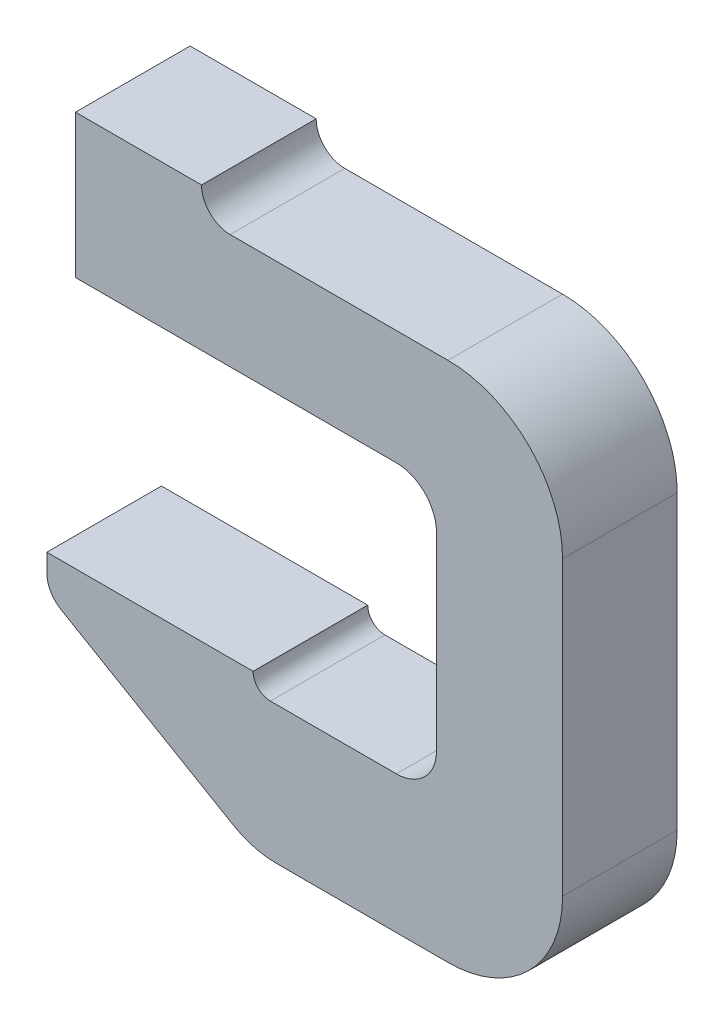
ISO-10303-21;
HEADER;
FILE_DESCRIPTION(('STEP AP214'),'2;1');
FILE_NAME('part.step','',(''),(''),'','','');
FILE_SCHEMA(('AUTOMOTIVE_DESIGN { 1 0 10303 214 1 1 1 1 }'));
ENDSEC;
DATA;
#1=APPLICATION_CONTEXT('core data for automotive mechanical design processes');
#2=APPLICATION_PROTOCOL_DEFINITION('international standard','automotive_design',2000,#1);
#3=PRODUCT_CONTEXT('',#1,'mechanical');
#4=PRODUCT('Part','Part','',(#3));
#5=PRODUCT_RELATED_PRODUCT_CATEGORY('part','',(#4));
#6=PRODUCT_DEFINITION_FORMATION('','',#4);
#7=PRODUCT_DEFINITION_CONTEXT('part definition',#1,'design');
#8=PRODUCT_DEFINITION('design','',#6,#7);
#9=PRODUCT_DEFINITION_SHAPE('','',#8);
#10=(LENGTH_UNIT() NAMED_UNIT(*) SI_UNIT(.MILLI.,.METRE.));
#11=(NAMED_UNIT(*) PLANE_ANGLE_UNIT() SI_UNIT($,.RADIAN.));
#12=(NAMED_UNIT(*) SI_UNIT($,.STERADIAN.) SOLID_ANGLE_UNIT());
#13=UNCERTAINTY_MEASURE_WITH_UNIT(LENGTH_MEASURE(1.E-05),#10,'distance_accuracy_value','');
#14=(GEOMETRIC_REPRESENTATION_CONTEXT(3) GLOBAL_UNCERTAINTY_ASSIGNED_CONTEXT((#13)) GLOBAL_UNIT_ASSIGNED_CONTEXT((#10,
#11,#12)) REPRESENTATION_CONTEXT('',''));
#15=CARTESIAN_POINT('',(0.,0.,0.));
#16=DIRECTION('',(0.,0.,1.));
#17=DIRECTION('',(1.,0.,0.));
#18=AXIS2_PLACEMENT_3D('',#15,#16,#17);
#19=CARTESIAN_POINT('',(-540.,0.,200.));
#20=DIRECTION('',(0.,1.,0.));
#21=DIRECTION('',(0.,0.,1.));
#22=AXIS2_PLACEMENT_3D('',#19,#20,#21);
#23=PLANE('',#22);
#24=DIRECTION('',(1.,0.,0.));
#25=VECTOR('',#24,1.);
#26=CARTESIAN_POINT('',(-540.,0.,200.));
#27=LINE('',#26,#25);
#28=CARTESIAN_POINT('',(-499.447628797504,0.,200.));
#29=VERTEX_POINT('',#28);
#30=CARTESIAN_POINT('',(-200.,0.,200.));
#31=VERTEX_POINT('',#30);
#32=EDGE_CURVE('E257',#29,#31,#27,.T.);
#33=ORIENTED_EDGE('',*,*,#32,.F.);
#34=DIRECTION('',(0.,0.,-1.));
#35=VECTOR('',#34,1.);
#36=CARTESIAN_POINT('',(-499.447628797504,0.,200.));
#37=LINE('',#36,#35);
#38=CARTESIAN_POINT('',(-499.447628797504,0.,0.));
#39=VERTEX_POINT('',#38);
#40=EDGE_CURVE('E250',#29,#39,#37,.T.);
#41=ORIENTED_EDGE('',*,*,#40,.T.);
#42=DIRECTION('',(1.,0.,0.));
#43=VECTOR('',#42,1.);
#44=CARTESIAN_POINT('',(-540.,0.,0.));
#45=LINE('',#44,#43);
#46=CARTESIAN_POINT('',(-200.,0.,0.));
#47=VERTEX_POINT('',#46);
#48=EDGE_CURVE('E256',#39,#47,#45,.T.);
#49=ORIENTED_EDGE('',*,*,#48,.T.);
#50=DIRECTION('',(0.,0.,-1.));
#51=VECTOR('',#50,1.);
#52=CARTESIAN_POINT('',(-200.,0.,200.));
#53=LINE('',#52,#51);
#54=EDGE_CURVE('E210',#47,#31,#53,.F.);
#55=ORIENTED_EDGE('',*,*,#54,.T.);
#56=EDGE_LOOP('',(#33,#41,#49,#55));
#57=FACE_BOUND('',#56,.T.);
#58=ADVANCED_FACE('F33',(#57),#23,.F.);
#59=CARTESIAN_POINT('',(0.,0.,200.));
#60=DIRECTION('',(-1.,0.,0.));
#61=DIRECTION('',(0.,0.,1.));
#62=AXIS2_PLACEMENT_3D('',#59,#60,#61);
#63=PLANE('',#62);
#64=DIRECTION('',(0.,1.,0.));
#65=VECTOR('',#64,1.);
#66=CARTESIAN_POINT('',(0.,0.,200.));
#67=LINE('',#66,#65);
#68=CARTESIAN_POINT('',(0.,200.,200.));
#69=VERTEX_POINT('',#68);
#70=CARTESIAN_POINT('',(0.,710.,200.));
#71=VERTEX_POINT('',#70);
#72=EDGE_CURVE('E521',#69,#71,#67,.T.);
#73=ORIENTED_EDGE('',*,*,#72,.F.);
#74=DIRECTION('',(0.,0.,-1.));
#75=VECTOR('',#74,1.);
#76=CARTESIAN_POINT('',(0.,200.,200.));
#77=LINE('',#76,#75);
#78=CARTESIAN_POINT('',(0.,200.,0.));
#79=VERTEX_POINT('',#78);
#80=EDGE_CURVE('E204',#69,#79,#77,.T.);
#81=ORIENTED_EDGE('',*,*,#80,.T.);
#82=DIRECTION('',(0.,1.,0.));
#83=VECTOR('',#82,1.);
#84=CARTESIAN_POINT('',(0.,0.,0.));
#85=LINE('',#84,#83);
#86=CARTESIAN_POINT('',(0.,710.,0.));
#87=VERTEX_POINT('',#86);
#88=EDGE_CURVE('E263',#79,#87,#85,.T.);
#89=ORIENTED_EDGE('',*,*,#88,.T.);
#90=DIRECTION('',(0.,0.,-1.));
#91=VECTOR('',#90,1.);
#92=CARTESIAN_POINT('',(0.,710.,200.));
#93=LINE('',#92,#91);
#94=EDGE_CURVE('E199',#87,#71,#93,.F.);
#95=ORIENTED_EDGE('',*,*,#94,.T.);
#96=EDGE_LOOP('',(#73,#81,#89,#95));
#97=FACE_BOUND('',#96,.T.);
#98=ADVANCED_FACE('F341',(#97),#63,.F.);
#99=CARTESIAN_POINT('',(0.,910.,200.));
#100=DIRECTION('',(0.,-1.,0.));
#101=DIRECTION('',(1.,0.,0.));
#102=AXIS2_PLACEMENT_3D('',#99,#100,#101);
#103=PLANE('',#102);
#104=DIRECTION('',(-1.,0.,0.));
#105=VECTOR('',#104,1.);
#106=CARTESIAN_POINT('',(0.,910.,0.));
#107=LINE('',#106,#105);
#108=CARTESIAN_POINT('',(-200.,910.,0.));
#109=VERTEX_POINT('',#108);
#110=CARTESIAN_POINT('',(-580.,910.,0.));
#111=VERTEX_POINT('',#110);
#112=EDGE_CURVE('E265',#109,#111,#107,.T.);
#113=ORIENTED_EDGE('',*,*,#112,.T.);
#114=DIRECTION('',(0.,0.,-1.));
#115=VECTOR('',#114,1.);
#116=CARTESIAN_POINT('',(-580.,910.,200.));
#117=LINE('',#116,#115);
#118=CARTESIAN_POINT('',(-580.,910.,200.));
#119=VERTEX_POINT('',#118);
#120=EDGE_CURVE('E239',#111,#119,#117,.F.);
#121=ORIENTED_EDGE('',*,*,#120,.T.);
#122=DIRECTION('',(-1.,0.,0.));
#123=VECTOR('',#122,1.);
#124=CARTESIAN_POINT('',(0.,910.,200.));
#125=LINE('',#124,#123);
#126=CARTESIAN_POINT('',(-200.,910.,200.));
#127=VERTEX_POINT('',#126);
#128=EDGE_CURVE('E170',#127,#119,#125,.T.);
#129=ORIENTED_EDGE('',*,*,#128,.F.);
#130=DIRECTION('',(0.,0.,-1.));
#131=VECTOR('',#130,1.);
#132=CARTESIAN_POINT('',(-200.,910.,200.));
#133=LINE('',#132,#131);
#134=EDGE_CURVE('E188',#127,#109,#133,.T.);
#135=ORIENTED_EDGE('',*,*,#134,.T.);
#136=EDGE_LOOP('',(#113,#121,#129,#135));
#137=FACE_BOUND('',#136,.T.);
#138=ADVANCED_FACE('F346',(#137),#103,.F.);
#139=CARTESIAN_POINT('',(-630.,960.,200.));
#140=DIRECTION('',(0.,-1.,0.));
#141=DIRECTION('',(0.,0.,-1.));
#142=AXIS2_PLACEMENT_3D('',#139,#140,#141);
#143=PLANE('',#142);
#144=DIRECTION('',(-1.,0.,0.));
#145=VECTOR('',#144,1.);
#146=CARTESIAN_POINT('',(-630.,960.,0.));
#147=LINE('',#146,#145);
#148=CARTESIAN_POINT('',(-630.,960.,0.));
#149=VERTEX_POINT('',#148);
#150=CARTESIAN_POINT('',(-850.,960.,0.));
#151=VERTEX_POINT('',#150);
#152=EDGE_CURVE('E273',#149,#151,#147,.T.);
#153=ORIENTED_EDGE('',*,*,#152,.T.);
#154=DIRECTION('',(0.,0.,-1.));
#155=VECTOR('',#154,1.);
#156=CARTESIAN_POINT('',(-850.,960.,200.));
#157=LINE('',#156,#155);
#158=CARTESIAN_POINT('',(-850.,960.,200.));
#159=VERTEX_POINT('',#158);
#160=EDGE_CURVE('E183',#159,#151,#157,.T.);
#161=ORIENTED_EDGE('',*,*,#160,.F.);
#162=DIRECTION('',(-1.,0.,0.));
#163=VECTOR('',#162,1.);
#164=CARTESIAN_POINT('',(-630.,960.,200.));
#165=LINE('',#164,#163);
#166=CARTESIAN_POINT('',(-630.,960.,200.));
#167=VERTEX_POINT('',#166);
#168=EDGE_CURVE('E167',#167,#159,#165,.T.);
#169=ORIENTED_EDGE('',*,*,#168,.F.);
#170=DIRECTION('',(0.,0.,-1.));
#171=VECTOR('',#170,1.);
#172=CARTESIAN_POINT('',(-630.,960.,200.));
#173=LINE('',#172,#171);
#174=EDGE_CURVE('E180',#167,#149,#173,.T.);
#175=ORIENTED_EDGE('',*,*,#174,.T.);
#176=EDGE_LOOP('',(#153,#161,#169,#175));
#177=FACE_BOUND('',#176,.T.);
#178=ADVANCED_FACE('F179',(#177),#143,.F.);
#179=CARTESIAN_POINT('',(-850.,960.,200.));
#180=DIRECTION('',(1.,0.,0.));
#181=DIRECTION('',(0.,0.,-1.));
#182=AXIS2_PLACEMENT_3D('',#179,#180,#181);
#183=PLANE('',#182);
#184=DIRECTION('',(0.,-1.,0.));
#185=VECTOR('',#184,1.);
#186=CARTESIAN_POINT('',(-850.,960.,0.));
#187=LINE('',#186,#185);
#188=CARTESIAN_POINT('',(-850.,710.,0.));
#189=VERTEX_POINT('',#188);
#190=EDGE_CURVE('E275',#151,#189,#187,.T.);
#191=ORIENTED_EDGE('',*,*,#190,.T.);
#192=DIRECTION('',(0.,0.,-1.));
#193=VECTOR('',#192,1.);
#194=CARTESIAN_POINT('',(-850.,710.,200.));
#195=LINE('',#194,#193);
#196=CARTESIAN_POINT('',(-850.,710.,200.));
#197=VERTEX_POINT('',#196);
#198=EDGE_CURVE('E193',#197,#189,#195,.T.);
#199=ORIENTED_EDGE('',*,*,#198,.F.);
#200=DIRECTION('',(0.,-1.,0.));
#201=VECTOR('',#200,1.);
#202=CARTESIAN_POINT('',(-850.,960.,200.));
#203=LINE('',#202,#201);
#204=EDGE_CURVE('E185',#159,#197,#203,.T.);
#205=ORIENTED_EDGE('',*,*,#204,.F.);
#206=ORIENTED_EDGE('',*,*,#160,.T.);
#207=EDGE_LOOP('',(#191,#199,#205,#206));
#208=FACE_BOUND('',#207,.T.);
#209=ADVANCED_FACE('F482',(#208),#183,.F.);
#210=CARTESIAN_POINT('',(-850.,710.,200.));
#211=DIRECTION('',(0.,1.,0.));
#212=DIRECTION('',(0.,0.,1.));
#213=AXIS2_PLACEMENT_3D('',#210,#211,#212);
#214=PLANE('',#213);
#215=DIRECTION('',(1.,0.,0.));
#216=VECTOR('',#215,1.);
#217=CARTESIAN_POINT('',(-850.,710.,0.));
#218=LINE('',#217,#216);
#219=CARTESIAN_POINT('',(-290.,710.,0.));
#220=VERTEX_POINT('',#219);
#221=EDGE_CURVE('E277',#189,#220,#218,.T.);
#222=ORIENTED_EDGE('',*,*,#221,.T.);
#223=DIRECTION('',(0.,0.,-1.));
#224=VECTOR('',#223,1.);
#225=CARTESIAN_POINT('',(-290.,710.,200.));
#226=LINE('',#225,#224);
#227=CARTESIAN_POINT('',(-290.,710.,200.));
#228=VERTEX_POINT('',#227);
#229=EDGE_CURVE('E218',#220,#228,#226,.F.);
#230=ORIENTED_EDGE('',*,*,#229,.T.);
#231=DIRECTION('',(1.,0.,0.));
#232=VECTOR('',#231,1.);
#233=CARTESIAN_POINT('',(-850.,710.,200.));
#234=LINE('',#233,#232);
#235=EDGE_CURVE('E306',#197,#228,#234,.T.);
#236=ORIENTED_EDGE('',*,*,#235,.F.);
#237=ORIENTED_EDGE('',*,*,#198,.T.);
#238=EDGE_LOOP('',(#222,#230,#236,#237));
#239=FACE_BOUND('',#238,.T.);
#240=ADVANCED_FACE('F303',(#239),#214,.F.);
#241=CARTESIAN_POINT('',(-220.,710.,200.));
#242=DIRECTION('',(1.,0.,0.));
#243=DIRECTION('',(0.,1.,0.));
#244=AXIS2_PLACEMENT_3D('',#241,#242,#243);
#245=PLANE('',#244);
#246=DIRECTION('',(0.,-1.,0.));
#247=VECTOR('',#246,1.);
#248=CARTESIAN_POINT('',(-220.,710.,0.));
#249=LINE('',#248,#247);
#250=CARTESIAN_POINT('',(-220.,640.,0.));
#251=VERTEX_POINT('',#250);
#252=CARTESIAN_POINT('',(-220.,310.,0.));
#253=VERTEX_POINT('',#252);
#254=EDGE_CURVE('E280',#251,#253,#249,.T.);
#255=ORIENTED_EDGE('',*,*,#254,.T.);
#256=DIRECTION('',(0.,0.,-1.));
#257=VECTOR('',#256,1.);
#258=CARTESIAN_POINT('',(-220.,310.,200.));
#259=LINE('',#258,#257);
#260=CARTESIAN_POINT('',(-220.,310.,200.));
#261=VERTEX_POINT('',#260);
#262=EDGE_CURVE('E227',#253,#261,#259,.F.);
#263=ORIENTED_EDGE('',*,*,#262,.T.);
#264=DIRECTION('',(0.,-1.,0.));
#265=VECTOR('',#264,1.);
#266=CARTESIAN_POINT('',(-220.,710.,200.));
#267=LINE('',#266,#265);
#268=CARTESIAN_POINT('',(-220.,640.,200.));
#269=VERTEX_POINT('',#268);
#270=EDGE_CURVE('E319',#269,#261,#267,.T.);
#271=ORIENTED_EDGE('',*,*,#270,.F.);
#272=DIRECTION('',(0.,0.,-1.));
#273=VECTOR('',#272,1.);
#274=CARTESIAN_POINT('',(-220.,640.,0.));
#275=LINE('',#274,#273);
#276=EDGE_CURVE('E215',#269,#251,#275,.T.);
#277=ORIENTED_EDGE('',*,*,#276,.T.);
#278=EDGE_LOOP('',(#255,#263,#271,#277));
#279=FACE_BOUND('',#278,.T.);
#280=ADVANCED_FACE('F316',(#279),#245,.F.);
#281=CARTESIAN_POINT('',(-220.,240.,200.));
#282=DIRECTION('',(0.,-1.,0.));
#283=DIRECTION('',(1.,0.,0.));
#284=AXIS2_PLACEMENT_3D('',#281,#282,#283);
#285=PLANE('',#284);
#286=DIRECTION('',(-1.,0.,0.));
#287=VECTOR('',#286,1.);
#288=CARTESIAN_POINT('',(-220.,240.,0.));
#289=LINE('',#288,#287);
#290=CARTESIAN_POINT('',(-290.,240.,0.));
#291=VERTEX_POINT('',#290);
#292=CARTESIAN_POINT('',(-510.,240.,0.));
#293=VERTEX_POINT('',#292);
#294=EDGE_CURVE('E283',#291,#293,#289,.T.);
#295=ORIENTED_EDGE('',*,*,#294,.T.);
#296=DIRECTION('',(0.,0.,-1.));
#297=VECTOR('',#296,1.);
#298=CARTESIAN_POINT('',(-510.,240.,200.));
#299=LINE('',#298,#297);
#300=CARTESIAN_POINT('',(-510.,240.,200.));
#301=VERTEX_POINT('',#300);
#302=EDGE_CURVE('E233',#293,#301,#299,.F.);
#303=ORIENTED_EDGE('',*,*,#302,.T.);
#304=DIRECTION('',(-1.,0.,0.));
#305=VECTOR('',#304,1.);
#306=CARTESIAN_POINT('',(-220.,240.,200.));
#307=LINE('',#306,#305);
#308=CARTESIAN_POINT('',(-290.,240.,200.));
#309=VERTEX_POINT('',#308);
#310=EDGE_CURVE('E321',#309,#301,#307,.T.);
#311=ORIENTED_EDGE('',*,*,#310,.F.);
#312=DIRECTION('',(0.,0.,-1.));
#313=VECTOR('',#312,1.);
#314=CARTESIAN_POINT('',(-290.,240.,0.));
#315=LINE('',#314,#313);
#316=EDGE_CURVE('E224',#309,#291,#315,.T.);
#317=ORIENTED_EDGE('',*,*,#316,.T.);
#318=EDGE_LOOP('',(#295,#303,#311,#317));
#319=FACE_BOUND('',#318,.T.);
#320=ADVANCED_FACE('F449',(#319),#285,.F.);
#321=CARTESIAN_POINT('',(-540.,270.,200.));
#322=DIRECTION('',(0.,-1.,0.));
#323=DIRECTION('',(1.,0.,0.));
#324=AXIS2_PLACEMENT_3D('',#321,#322,#323);
#325=PLANE('',#324);
#326=DIRECTION('',(-1.,0.,0.));
#327=VECTOR('',#326,1.);
#328=CARTESIAN_POINT('',(-540.,270.,0.));
#329=LINE('',#328,#327);
#330=CARTESIAN_POINT('',(-540.,270.,0.));
#331=VERTEX_POINT('',#330);
#332=CARTESIAN_POINT('',(-900.,270.,0.));
#333=VERTEX_POINT('',#332);
#334=EDGE_CURVE('E286',#331,#333,#329,.T.);
#335=ORIENTED_EDGE('',*,*,#334,.T.);
#336=DIRECTION('',(0.,0.,-1.));
#337=VECTOR('',#336,1.);
#338=CARTESIAN_POINT('',(-900.,270.,200.));
#339=LINE('',#338,#337);
#340=CARTESIAN_POINT('',(-900.,270.,200.));
#341=VERTEX_POINT('',#340);
#342=EDGE_CURVE('E293',#341,#333,#339,.T.);
#343=ORIENTED_EDGE('',*,*,#342,.F.);
#344=DIRECTION('',(-1.,0.,0.));
#345=VECTOR('',#344,1.);
#346=CARTESIAN_POINT('',(-540.,270.,200.));
#347=LINE('',#346,#345);
#348=CARTESIAN_POINT('',(-540.,270.,200.));
#349=VERTEX_POINT('',#348);
#350=EDGE_CURVE('E324',#349,#341,#347,.T.);
#351=ORIENTED_EDGE('',*,*,#350,.F.);
#352=DIRECTION('',(0.,0.,-1.));
#353=VECTOR('',#352,1.);
#354=CARTESIAN_POINT('',(-540.,270.,200.));
#355=LINE('',#354,#353);
#356=EDGE_CURVE('E296',#349,#331,#355,.T.);
#357=ORIENTED_EDGE('',*,*,#356,.T.);
#358=EDGE_LOOP('',(#335,#343,#351,#357));
#359=FACE_BOUND('',#358,.T.);
#360=ADVANCED_FACE('F454',(#359),#325,.F.);
#361=CARTESIAN_POINT('',(-900.,270.,200.));
#362=DIRECTION('',(1.,0.,0.));
#363=DIRECTION('',(0.,0.,-1.));
#364=AXIS2_PLACEMENT_3D('',#361,#362,#363);
#365=PLANE('',#364);
#366=DIRECTION('',(0.,-1.,0.));
#367=VECTOR('',#366,1.);
#368=CARTESIAN_POINT('',(-900.,270.,0.));
#369=LINE('',#368,#367);
#370=CARTESIAN_POINT('',(-900.,238.718516622707,0.));
#371=VERTEX_POINT('',#370);
#372=EDGE_CURVE('E288',#333,#371,#369,.T.);
#373=ORIENTED_EDGE('',*,*,#372,.T.);
#374=DIRECTION('',(0.,0.,-1.));
#375=VECTOR('',#374,1.);
#376=CARTESIAN_POINT('',(-900.,238.718516622707,200.));
#377=LINE('',#376,#375);
#378=CARTESIAN_POINT('',(-900.,238.718516622707,200.));
#379=VERTEX_POINT('',#378);
#380=EDGE_CURVE('E246',#371,#379,#377,.F.);
#381=ORIENTED_EDGE('',*,*,#380,.T.);
#382=DIRECTION('',(0.,-1.,0.));
#383=VECTOR('',#382,1.);
#384=CARTESIAN_POINT('',(-900.,270.,200.));
#385=LINE('',#384,#383);
#386=EDGE_CURVE('E329',#341,#379,#385,.T.);
#387=ORIENTED_EDGE('',*,*,#386,.F.);
#388=ORIENTED_EDGE('',*,*,#342,.T.);
#389=EDGE_LOOP('',(#373,#381,#387,#388));
#390=FACE_BOUND('',#389,.T.);
#391=ADVANCED_FACE('F385',(#390),#365,.F.);
#392=CARTESIAN_POINT('',(-900.,210.,200.));
#393=DIRECTION('',(0.503871025524086,0.863778900898434,0.));
#394=DIRECTION('',(-0.863778900898434,0.503871025524086,0.));
#395=AXIS2_PLACEMENT_3D('',#392,#393,#394);
#396=PLANE('',#395);
#397=DIRECTION('',(0.863778900898434,-0.503871025524086,0.));
#398=VECTOR('',#397,1.);
#399=CARTESIAN_POINT('',(-900.,210.,0.));
#400=LINE('',#399,#398);
#401=CARTESIAN_POINT('',(-875.193551276204,195.529571577786,0.));
#402=VERTEX_POINT('',#401);
#403=CARTESIAN_POINT('',(-575.028282626117,20.433164865235,0.));
#404=VERTEX_POINT('',#403);
#405=EDGE_CURVE('E291',#402,#404,#400,.T.);
#406=ORIENTED_EDGE('',*,*,#405,.T.);
#407=DIRECTION('',(0.,0.,-1.));
#408=VECTOR('',#407,1.);
#409=CARTESIAN_POINT('',(-575.028282626117,20.433164865235,200.));
#410=LINE('',#409,#408);
#411=CARTESIAN_POINT('',(-575.028282626117,20.433164865235,200.));
#412=VERTEX_POINT('',#411);
#413=EDGE_CURVE('E41',#404,#412,#410,.F.);
#414=ORIENTED_EDGE('',*,*,#413,.T.);
#415=DIRECTION('',(0.863778900898434,-0.503871025524086,0.));
#416=VECTOR('',#415,1.);
#417=CARTESIAN_POINT('',(-900.,210.,200.));
#418=LINE('',#417,#416);
#419=CARTESIAN_POINT('',(-875.193551276204,195.529571577786,200.));
#420=VERTEX_POINT('',#419);
#421=EDGE_CURVE('E268',#420,#412,#418,.T.);
#422=ORIENTED_EDGE('',*,*,#421,.F.);
#423=DIRECTION('',(0.,0.,-1.));
#424=VECTOR('',#423,1.);
#425=CARTESIAN_POINT('',(-875.193551276204,195.529571577786,200.));
#426=LINE('',#425,#424);
#427=EDGE_CURVE('E174',#420,#402,#426,.T.);
#428=ORIENTED_EDGE('',*,*,#427,.T.);
#429=EDGE_LOOP('',(#406,#414,#422,#428));
#430=FACE_BOUND('',#429,.T.);
#431=ADVANCED_FACE('F395',(#430),#396,.F.);
#432=CARTESIAN_POINT('',(0.,0.,200.));
#433=DIRECTION('',(0.,0.,1.));
#434=DIRECTION('',(1.,0.,0.));
#435=AXIS2_PLACEMENT_3D('',#432,#433,#434);
#436=PLANE('',#435);
#437=ORIENTED_EDGE('',*,*,#421,.T.);
#438=CARTESIAN_POINT('',(-499.447628797504,150.,200.));
#439=DIRECTION('',(0.,0.,1.));
#440=DIRECTION('',(1.,0.,0.));
#441=AXIS2_PLACEMENT_3D('',#438,#439,#440);
#442=CIRCLE('',#441,150.);
#443=EDGE_CURVE('E11',#412,#29,#442,.T.);
#444=ORIENTED_EDGE('',*,*,#443,.T.);
#445=ORIENTED_EDGE('',*,*,#32,.T.);
#446=CARTESIAN_POINT('',(-200.,200.,200.));
#447=DIRECTION('',(0.,0.,1.));
#448=DIRECTION('',(1.,0.,0.));
#449=AXIS2_PLACEMENT_3D('',#446,#447,#448);
#450=CIRCLE('',#449,200.);
#451=EDGE_CURVE('E213',#31,#69,#450,.T.);
#452=ORIENTED_EDGE('',*,*,#451,.T.);
#453=ORIENTED_EDGE('',*,*,#72,.T.);
#454=CARTESIAN_POINT('',(-200.,710.,200.));
#455=DIRECTION('',(0.,0.,1.));
#456=DIRECTION('',(1.,0.,0.));
#457=AXIS2_PLACEMENT_3D('',#454,#455,#456);
#458=CIRCLE('',#457,200.);
#459=EDGE_CURVE('E202',#71,#127,#458,.T.);
#460=ORIENTED_EDGE('',*,*,#459,.T.);
#461=ORIENTED_EDGE('',*,*,#128,.T.);
#462=CARTESIAN_POINT('',(-580.,960.,200.));
#463=DIRECTION('',(0.,0.,1.));
#464=DIRECTION('',(1.,0.,0.));
#465=AXIS2_PLACEMENT_3D('',#462,#463,#464);
#466=CIRCLE('',#465,50.);
#467=EDGE_CURVE('E164',#119,#167,#466,.F.);
#468=ORIENTED_EDGE('',*,*,#467,.T.);
#469=ORIENTED_EDGE('',*,*,#168,.T.);
#470=ORIENTED_EDGE('',*,*,#204,.T.);
#471=ORIENTED_EDGE('',*,*,#235,.T.);
#472=CARTESIAN_POINT('',(-290.,640.,200.));
#473=DIRECTION('',(0.,0.,1.));
#474=DIRECTION('',(1.,0.,0.));
#475=AXIS2_PLACEMENT_3D('',#472,#473,#474);
#476=CIRCLE('',#475,70.);
#477=EDGE_CURVE('E222',#228,#269,#476,.F.);
#478=ORIENTED_EDGE('',*,*,#477,.T.);
#479=ORIENTED_EDGE('',*,*,#270,.T.);
#480=CARTESIAN_POINT('',(-290.,310.,200.));
#481=DIRECTION('',(0.,0.,1.));
#482=DIRECTION('',(1.,0.,0.));
#483=AXIS2_PLACEMENT_3D('',#480,#481,#482);
#484=CIRCLE('',#483,70.);
#485=EDGE_CURVE('E231',#261,#309,#484,.F.);
#486=ORIENTED_EDGE('',*,*,#485,.T.);
#487=ORIENTED_EDGE('',*,*,#310,.T.);
#488=CARTESIAN_POINT('',(-510.,270.,200.));
#489=DIRECTION('',(0.,0.,1.));
#490=DIRECTION('',(1.,0.,0.));
#491=AXIS2_PLACEMENT_3D('',#488,#489,#490);
#492=CIRCLE('',#491,30.);
#493=EDGE_CURVE('E237',#301,#349,#492,.F.);
#494=ORIENTED_EDGE('',*,*,#493,.T.);
#495=ORIENTED_EDGE('',*,*,#350,.T.);
#496=ORIENTED_EDGE('',*,*,#386,.T.);
#497=CARTESIAN_POINT('',(-850.,238.718516622707,200.));
#498=DIRECTION('',(0.,0.,1.));
#499=DIRECTION('',(1.,0.,0.));
#500=AXIS2_PLACEMENT_3D('',#497,#498,#499);
#501=CIRCLE('',#500,50.);
#502=EDGE_CURVE('E248',#379,#420,#501,.T.);
#503=ORIENTED_EDGE('',*,*,#502,.T.);
#504=EDGE_LOOP('',(#437,#444,#445,#452,#453,#460,#461,#468,#469,#470,#471,#478,#479,#486,#487,
#494,#495,#496,#503));
#505=FACE_BOUND('',#504,.T.);
#506=ADVANCED_FACE('F166',(#505),#436,.T.);
#507=CARTESIAN_POINT('',(0.,0.,0.));
#508=DIRECTION('',(0.,0.,1.));
#509=DIRECTION('',(1.,0.,0.));
#510=AXIS2_PLACEMENT_3D('',#507,#508,#509);
#511=PLANE('',#510);
#512=ORIENTED_EDGE('',*,*,#48,.F.);
#513=CARTESIAN_POINT('',(-499.447628797504,150.,0.));
#514=DIRECTION('',(0.,0.,1.));
#515=DIRECTION('',(1.,0.,0.));
#516=AXIS2_PLACEMENT_3D('',#513,#514,#515);
#517=CIRCLE('',#516,150.);
#518=EDGE_CURVE('E55',#39,#404,#517,.F.);
#519=ORIENTED_EDGE('',*,*,#518,.T.);
#520=ORIENTED_EDGE('',*,*,#405,.F.);
#521=CARTESIAN_POINT('',(-850.,238.718516622707,0.));
#522=DIRECTION('',(0.,0.,1.));
#523=DIRECTION('',(1.,0.,0.));
#524=AXIS2_PLACEMENT_3D('',#521,#522,#523);
#525=CIRCLE('',#524,50.);
#526=EDGE_CURVE('E244',#402,#371,#525,.F.);
#527=ORIENTED_EDGE('',*,*,#526,.T.);
#528=ORIENTED_EDGE('',*,*,#372,.F.);
#529=ORIENTED_EDGE('',*,*,#334,.F.);
#530=CARTESIAN_POINT('',(-510.,270.,0.));
#531=DIRECTION('',(0.,0.,1.));
#532=DIRECTION('',(1.,0.,0.));
#533=AXIS2_PLACEMENT_3D('',#530,#531,#532);
#534=CIRCLE('',#533,30.);
#535=EDGE_CURVE('E235',#331,#293,#534,.T.);
#536=ORIENTED_EDGE('',*,*,#535,.T.);
#537=ORIENTED_EDGE('',*,*,#294,.F.);
#538=CARTESIAN_POINT('',(-290.,310.,0.));
#539=DIRECTION('',(0.,0.,1.));
#540=DIRECTION('',(1.,0.,0.));
#541=AXIS2_PLACEMENT_3D('',#538,#539,#540);
#542=CIRCLE('',#541,70.);
#543=EDGE_CURVE('E229',#291,#253,#542,.T.);
#544=ORIENTED_EDGE('',*,*,#543,.T.);
#545=ORIENTED_EDGE('',*,*,#254,.F.);
#546=CARTESIAN_POINT('',(-290.,640.,0.));
#547=DIRECTION('',(0.,0.,1.));
#548=DIRECTION('',(1.,0.,0.));
#549=AXIS2_PLACEMENT_3D('',#546,#547,#548);
#550=CIRCLE('',#549,70.);
#551=EDGE_CURVE('E220',#251,#220,#550,.T.);
#552=ORIENTED_EDGE('',*,*,#551,.T.);
#553=ORIENTED_EDGE('',*,*,#221,.F.);
#554=ORIENTED_EDGE('',*,*,#190,.F.);
#555=ORIENTED_EDGE('',*,*,#152,.F.);
#556=CARTESIAN_POINT('',(-580.,960.,0.));
#557=DIRECTION('',(0.,0.,1.));
#558=DIRECTION('',(1.,0.,0.));
#559=AXIS2_PLACEMENT_3D('',#556,#557,#558);
#560=CIRCLE('',#559,50.);
#561=EDGE_CURVE('E175',#149,#111,#560,.T.);
#562=ORIENTED_EDGE('',*,*,#561,.T.);
#563=ORIENTED_EDGE('',*,*,#112,.F.);
#564=CARTESIAN_POINT('',(-200.,710.,0.));
#565=DIRECTION('',(0.,0.,1.));
#566=DIRECTION('',(1.,0.,0.));
#567=AXIS2_PLACEMENT_3D('',#564,#565,#566);
#568=CIRCLE('',#567,200.);
#569=EDGE_CURVE('E191',#109,#87,#568,.F.);
#570=ORIENTED_EDGE('',*,*,#569,.T.);
#571=ORIENTED_EDGE('',*,*,#88,.F.);
#572=CARTESIAN_POINT('',(-200.,200.,0.));
#573=DIRECTION('',(0.,0.,1.));
#574=DIRECTION('',(1.,0.,0.));
#575=AXIS2_PLACEMENT_3D('',#572,#573,#574);
#576=CIRCLE('',#575,200.);
#577=EDGE_CURVE('E207',#79,#47,#576,.F.);
#578=ORIENTED_EDGE('',*,*,#577,.T.);
#579=EDGE_LOOP('',(#512,#519,#520,#527,#528,#529,#536,#537,#544,#545,#552,#553,#554,#555,#562,
#563,#570,#571,#578));
#580=FACE_BOUND('',#579,.T.);
#581=ADVANCED_FACE('F260',(#580),#511,.F.);
#582=CARTESIAN_POINT('',(-200.,710.,200.));
#583=DIRECTION('',(0.,0.,-1.));
#584=DIRECTION('',(-1.,0.,0.));
#585=AXIS2_PLACEMENT_3D('',#582,#583,#584);
#586=CYLINDRICAL_SURFACE('',#585,200.);
#587=ORIENTED_EDGE('',*,*,#459,.F.);
#588=ORIENTED_EDGE('',*,*,#94,.F.);
#589=ORIENTED_EDGE('',*,*,#569,.F.);
#590=ORIENTED_EDGE('',*,*,#134,.F.);
#591=EDGE_LOOP('',(#587,#588,#589,#590));
#592=FACE_BOUND('',#591,.T.);
#593=ADVANCED_FACE('F351',(#592),#586,.T.);
#594=CARTESIAN_POINT('',(-200.,200.,200.));
#595=DIRECTION('',(0.,0.,-1.));
#596=DIRECTION('',(-1.,0.,0.));
#597=AXIS2_PLACEMENT_3D('',#594,#595,#596);
#598=CYLINDRICAL_SURFACE('',#597,200.);
#599=ORIENTED_EDGE('',*,*,#451,.F.);
#600=ORIENTED_EDGE('',*,*,#54,.F.);
#601=ORIENTED_EDGE('',*,*,#577,.F.);
#602=ORIENTED_EDGE('',*,*,#80,.F.);
#603=EDGE_LOOP('',(#599,#600,#601,#602));
#604=FACE_BOUND('',#603,.T.);
#605=ADVANCED_FACE('F354',(#604),#598,.T.);
#606=CARTESIAN_POINT('',(-290.,640.,200.));
#607=DIRECTION('',(0.,0.,1.));
#608=DIRECTION('',(1.,0.,0.));
#609=AXIS2_PLACEMENT_3D('',#606,#607,#608);
#610=CYLINDRICAL_SURFACE('',#609,70.);
#611=ORIENTED_EDGE('',*,*,#477,.F.);
#612=ORIENTED_EDGE('',*,*,#229,.F.);
#613=ORIENTED_EDGE('',*,*,#551,.F.);
#614=ORIENTED_EDGE('',*,*,#276,.F.);
#615=EDGE_LOOP('',(#611,#612,#613,#614));
#616=FACE_BOUND('',#615,.T.);
#617=ADVANCED_FACE('F313',(#616),#610,.F.);
#618=CARTESIAN_POINT('',(-290.,310.,200.));
#619=DIRECTION('',(0.,0.,1.));
#620=DIRECTION('',(1.,0.,0.));
#621=AXIS2_PLACEMENT_3D('',#618,#619,#620);
#622=CYLINDRICAL_SURFACE('',#621,70.);
#623=ORIENTED_EDGE('',*,*,#485,.F.);
#624=ORIENTED_EDGE('',*,*,#262,.F.);
#625=ORIENTED_EDGE('',*,*,#543,.F.);
#626=ORIENTED_EDGE('',*,*,#316,.F.);
#627=EDGE_LOOP('',(#623,#624,#625,#626));
#628=FACE_BOUND('',#627,.T.);
#629=ADVANCED_FACE('F361',(#628),#622,.F.);
#630=CARTESIAN_POINT('',(-510.,270.,200.));
#631=DIRECTION('',(0.,0.,1.));
#632=DIRECTION('',(1.,0.,0.));
#633=AXIS2_PLACEMENT_3D('',#630,#631,#632);
#634=CYLINDRICAL_SURFACE('',#633,30.);
#635=ORIENTED_EDGE('',*,*,#493,.F.);
#636=ORIENTED_EDGE('',*,*,#302,.F.);
#637=ORIENTED_EDGE('',*,*,#535,.F.);
#638=ORIENTED_EDGE('',*,*,#356,.F.);
#639=EDGE_LOOP('',(#635,#636,#637,#638));
#640=FACE_BOUND('',#639,.T.);
#641=ADVANCED_FACE('F364',(#640),#634,.F.);
#642=CARTESIAN_POINT('',(-580.,960.,200.));
#643=DIRECTION('',(0.,0.,1.));
#644=DIRECTION('',(1.,0.,0.));
#645=AXIS2_PLACEMENT_3D('',#642,#643,#644);
#646=CYLINDRICAL_SURFACE('',#645,50.);
#647=ORIENTED_EDGE('',*,*,#467,.F.);
#648=ORIENTED_EDGE('',*,*,#120,.F.);
#649=ORIENTED_EDGE('',*,*,#561,.F.);
#650=ORIENTED_EDGE('',*,*,#174,.F.);
#651=EDGE_LOOP('',(#647,#648,#649,#650));
#652=FACE_BOUND('',#651,.T.);
#653=ADVANCED_FACE('F187',(#652),#646,.F.);
#654=CARTESIAN_POINT('',(-850.,238.718516622707,200.));
#655=DIRECTION('',(0.,0.,-1.));
#656=DIRECTION('',(-1.,0.,0.));
#657=AXIS2_PLACEMENT_3D('',#654,#655,#656);
#658=CYLINDRICAL_SURFACE('',#657,50.);
#659=ORIENTED_EDGE('',*,*,#502,.F.);
#660=ORIENTED_EDGE('',*,*,#380,.F.);
#661=ORIENTED_EDGE('',*,*,#526,.F.);
#662=ORIENTED_EDGE('',*,*,#427,.F.);
#663=EDGE_LOOP('',(#659,#660,#661,#662));
#664=FACE_BOUND('',#663,.T.);
#665=ADVANCED_FACE('F335',(#664),#658,.T.);
#666=CARTESIAN_POINT('',(-499.447628797504,150.,200.));
#667=DIRECTION('',(0.,0.,-1.));
#668=DIRECTION('',(-1.,0.,0.));
#669=AXIS2_PLACEMENT_3D('',#666,#667,#668);
#670=CYLINDRICAL_SURFACE('',#669,150.);
#671=ORIENTED_EDGE('',*,*,#443,.F.);
#672=ORIENTED_EDGE('',*,*,#413,.F.);
#673=ORIENTED_EDGE('',*,*,#518,.F.);
#674=ORIENTED_EDGE('',*,*,#40,.F.);
#675=EDGE_LOOP('',(#671,#672,#673,#674));
#676=FACE_BOUND('',#675,.T.);
#677=ADVANCED_FACE('F35',(#676),#670,.T.);
#678=CLOSED_SHELL('',(#58,#98,#138,#178,#209,#240,#280,#320,#360,#391,#431,#506,#581,#593,#605,
#617,#629,#641,#653,#665,#677));
#679=MANIFOLD_SOLID_BREP('B2',#678);
#680=ADVANCED_BREP_SHAPE_REPRESENTATION('',(#18,#679),#14);
#681=SHAPE_DEFINITION_REPRESENTATION(#9,#680);
ENDSEC;
END-ISO-10303-21;
